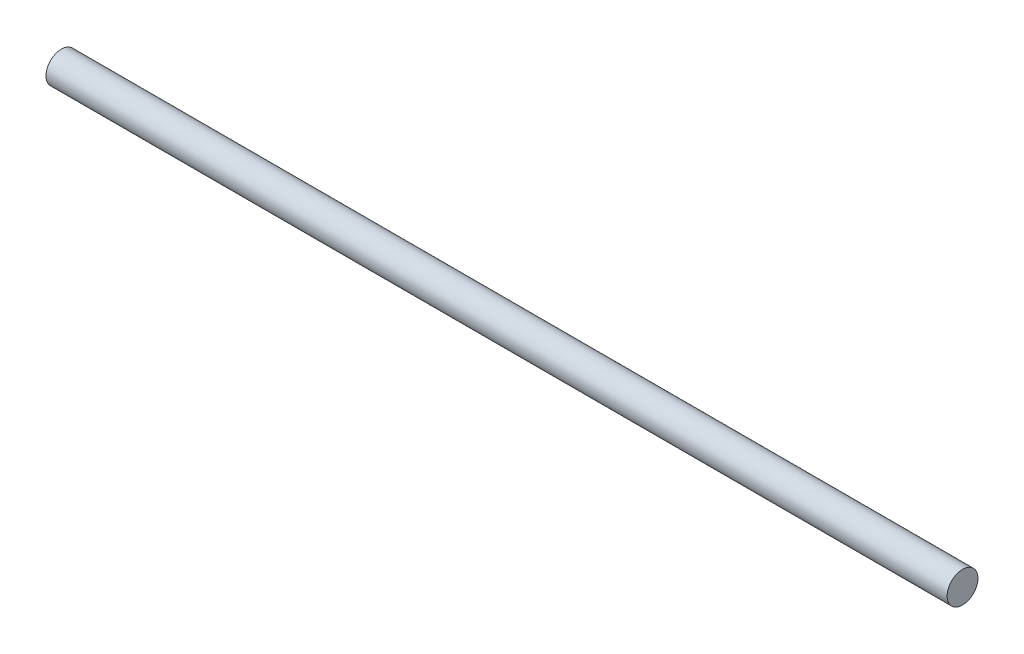
ISO-10303-21;
HEADER;
FILE_DESCRIPTION(('STEP AP214'),'2;1');
FILE_NAME('part.step','',(''),(''),'','','');
FILE_SCHEMA(('AUTOMOTIVE_DESIGN { 1 0 10303 214 1 1 1 1 }'));
ENDSEC;
DATA;
#1=APPLICATION_CONTEXT('core data for automotive mechanical design processes');
#2=APPLICATION_PROTOCOL_DEFINITION('international standard','automotive_design',2000,#1);
#3=PRODUCT_CONTEXT('',#1,'mechanical');
#4=PRODUCT('Part','Part','',(#3));
#5=PRODUCT_RELATED_PRODUCT_CATEGORY('part','',(#4));
#6=PRODUCT_DEFINITION_FORMATION('','',#4);
#7=PRODUCT_DEFINITION_CONTEXT('part definition',#1,'design');
#8=PRODUCT_DEFINITION('design','',#6,#7);
#9=PRODUCT_DEFINITION_SHAPE('','',#8);
#10=(LENGTH_UNIT() NAMED_UNIT(*) SI_UNIT(.MILLI.,.METRE.));
#11=(NAMED_UNIT(*) PLANE_ANGLE_UNIT() SI_UNIT($,.RADIAN.));
#12=(NAMED_UNIT(*) SI_UNIT($,.STERADIAN.) SOLID_ANGLE_UNIT());
#13=UNCERTAINTY_MEASURE_WITH_UNIT(LENGTH_MEASURE(1.E-05),#10,'distance_accuracy_value','');
#14=(GEOMETRIC_REPRESENTATION_CONTEXT(3) GLOBAL_UNCERTAINTY_ASSIGNED_CONTEXT((#13)) GLOBAL_UNIT_ASSIGNED_CONTEXT((#10,
#11,#12)) REPRESENTATION_CONTEXT('',''));
#15=CARTESIAN_POINT('',(0.,0.,0.));
#16=DIRECTION('',(0.,0.,1.));
#17=DIRECTION('',(1.,0.,0.));
#18=AXIS2_PLACEMENT_3D('',#15,#16,#17);
#19=CARTESIAN_POINT('',(875.,0.,0.));
#20=DIRECTION('',(-1.,0.,0.));
#21=DIRECTION('',(0.,0.,1.));
#22=AXIS2_PLACEMENT_3D('',#19,#20,#21);
#23=CYLINDRICAL_SURFACE('',#22,15.);
#24=CARTESIAN_POINT('',(875.,0.,0.));
#25=DIRECTION('',(1.,0.,0.));
#26=DIRECTION('',(0.,0.,-1.));
#27=AXIS2_PLACEMENT_3D('',#24,#25,#26);
#28=CIRCLE('',#27,15.);
#29=CARTESIAN_POINT('',(875.,0.,-15.));
#30=VERTEX_POINT('',#29);
#31=EDGE_CURVE('E10',#30,#30,#28,.T.);
#32=ORIENTED_EDGE('',*,*,#31,.F.);
#33=EDGE_LOOP('',(#32));
#34=FACE_BOUND('',#33,.T.);
#35=CARTESIAN_POINT('',(0.,0.,0.));
#36=DIRECTION('',(1.,0.,0.));
#37=DIRECTION('',(0.,0.,-1.));
#38=AXIS2_PLACEMENT_3D('',#35,#36,#37);
#39=CIRCLE('',#38,15.);
#40=CARTESIAN_POINT('',(0.,0.,-15.));
#41=VERTEX_POINT('',#40);
#42=EDGE_CURVE('E40',#41,#41,#39,.T.);
#43=ORIENTED_EDGE('',*,*,#42,.T.);
#44=EDGE_LOOP('',(#43));
#45=FACE_BOUND('',#44,.T.);
#46=ADVANCED_FACE('F37',(#34,#45),#23,.T.);
#47=CARTESIAN_POINT('',(875.,0.,0.));
#48=DIRECTION('',(1.,0.,0.));
#49=DIRECTION('',(0.,0.,-1.));
#50=AXIS2_PLACEMENT_3D('',#47,#48,#49);
#51=PLANE('',#50);
#52=ORIENTED_EDGE('',*,*,#31,.T.);
#53=EDGE_LOOP('',(#52));
#54=FACE_BOUND('',#53,.T.);
#55=ADVANCED_FACE('F54',(#54),#51,.T.);
#56=CARTESIAN_POINT('',(0.,0.,0.));
#57=DIRECTION('',(1.,0.,0.));
#58=DIRECTION('',(0.,0.,-1.));
#59=AXIS2_PLACEMENT_3D('',#56,#57,#58);
#60=PLANE('',#59);
#61=ORIENTED_EDGE('',*,*,#42,.F.);
#62=EDGE_LOOP('',(#61));
#63=FACE_BOUND('',#62,.T.);
#64=ADVANCED_FACE('F52',(#63),#60,.F.);
#65=CLOSED_SHELL('',(#46,#55,#64));
#66=MANIFOLD_SOLID_BREP('B2',#65);
#67=ADVANCED_BREP_SHAPE_REPRESENTATION('',(#18,#66),#14);
#68=SHAPE_DEFINITION_REPRESENTATION(#9,#67);
ENDSEC;
END-ISO-10303-21;
